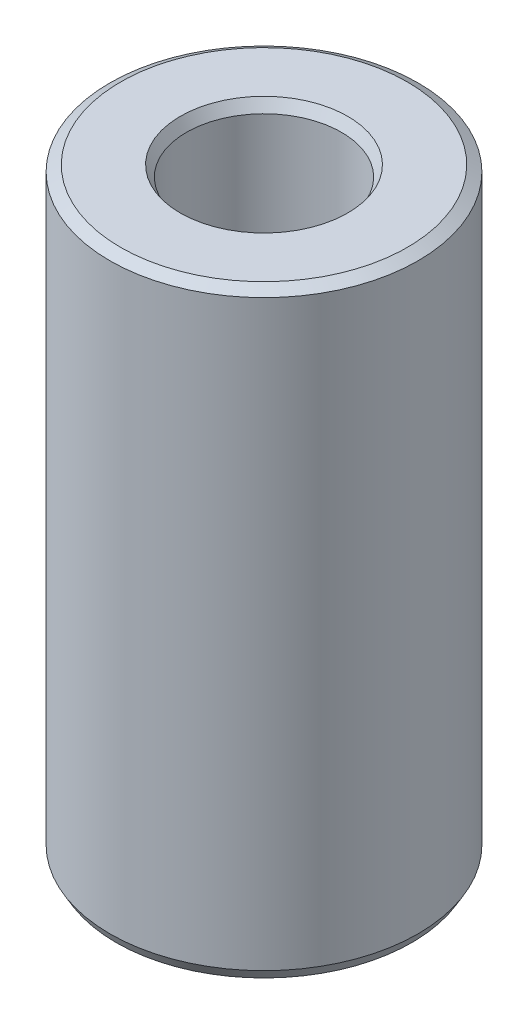
ISO-10303-21;
HEADER;
FILE_DESCRIPTION(('STEP AP214'),'2;1');
FILE_NAME('part.step','',(''),(''),'','','');
FILE_SCHEMA(('AUTOMOTIVE_DESIGN { 1 0 10303 214 1 1 1 1 }'));
ENDSEC;
DATA;
#1=APPLICATION_CONTEXT('core data for automotive mechanical design processes');
#2=APPLICATION_PROTOCOL_DEFINITION('international standard','automotive_design',2000,#1);
#3=PRODUCT_CONTEXT('',#1,'mechanical');
#4=PRODUCT('Part','Part','',(#3));
#5=PRODUCT_RELATED_PRODUCT_CATEGORY('part','',(#4));
#6=PRODUCT_DEFINITION_FORMATION('','',#4);
#7=PRODUCT_DEFINITION_CONTEXT('part definition',#1,'design');
#8=PRODUCT_DEFINITION('design','',#6,#7);
#9=PRODUCT_DEFINITION_SHAPE('','',#8);
#10=(LENGTH_UNIT() NAMED_UNIT(*) SI_UNIT(.MILLI.,.METRE.));
#11=(NAMED_UNIT(*) PLANE_ANGLE_UNIT() SI_UNIT($,.RADIAN.));
#12=(NAMED_UNIT(*) SI_UNIT($,.STERADIAN.) SOLID_ANGLE_UNIT());
#13=UNCERTAINTY_MEASURE_WITH_UNIT(LENGTH_MEASURE(1.E-05),#10,'distance_accuracy_value','');
#14=(GEOMETRIC_REPRESENTATION_CONTEXT(3) GLOBAL_UNCERTAINTY_ASSIGNED_CONTEXT((#13)) GLOBAL_UNIT_ASSIGNED_CONTEXT((#10,
#11,#12)) REPRESENTATION_CONTEXT('',''));
#15=CARTESIAN_POINT('',(0.,0.,0.));
#16=DIRECTION('',(0.,0.,1.));
#17=DIRECTION('',(1.,0.,0.));
#18=AXIS2_PLACEMENT_3D('',#15,#16,#17);
#19=CARTESIAN_POINT('',(0.,204.351669063772,0.));
#20=DIRECTION('',(0.,-1.,0.));
#21=DIRECTION('',(0.,0.,-1.));
#22=AXIS2_PLACEMENT_3D('',#19,#20,#21);
#23=CYLINDRICAL_SURFACE('',#22,52.5);
#24=CARTESIAN_POINT('',(0.,3.659429780245,0.));
#25=DIRECTION('',(0.,1.,0.));
#26=DIRECTION('',(0.,0.,1.));
#27=AXIS2_PLACEMENT_3D('',#24,#25,#26);
#28=CIRCLE('',#27,52.5);
#29=CARTESIAN_POINT('',(0.,3.659429780245,52.5));
#30=VERTEX_POINT('',#29);
#31=EDGE_CURVE('E10',#30,#30,#28,.T.);
#32=ORIENTED_EDGE('',*,*,#31,.T.);
#33=EDGE_LOOP('',(#32));
#34=FACE_BOUND('',#33,.T.);
#35=CARTESIAN_POINT('',(0.,202.238896295067,0.));
#36=DIRECTION('',(0.,1.,0.));
#37=DIRECTION('',(0.,0.,1.));
#38=AXIS2_PLACEMENT_3D('',#35,#36,#37);
#39=CIRCLE('',#38,52.5);
#40=CARTESIAN_POINT('',(0.,202.238896295067,52.5));
#41=VERTEX_POINT('',#40);
#42=EDGE_CURVE('E50',#41,#41,#39,.F.);
#43=ORIENTED_EDGE('',*,*,#42,.T.);
#44=EDGE_LOOP('',(#43));
#45=FACE_BOUND('',#44,.T.);
#46=ADVANCED_FACE('F39',(#34,#45),#23,.T.);
#47=CARTESIAN_POINT('',(0.,204.351669063772,0.));
#48=DIRECTION('',(0.,1.,0.));
#49=DIRECTION('',(0.,0.,1.));
#50=AXIS2_PLACEMENT_3D('',#47,#48,#49);
#51=PLANE('',#50);
#52=CARTESIAN_POINT('',(0.,204.351669063772,0.));
#53=DIRECTION('',(0.,1.,0.));
#54=DIRECTION('',(0.,0.,1.));
#55=AXIS2_PLACEMENT_3D('',#52,#53,#54);
#56=CIRCLE('',#55,28.5397225921579);
#57=CARTESIAN_POINT('',(0.,204.351669063772,28.5397225921579));
#58=VERTEX_POINT('',#57);
#59=EDGE_CURVE('E58',#58,#58,#56,.F.);
#60=ORIENTED_EDGE('',*,*,#59,.T.);
#61=EDGE_LOOP('',(#60));
#62=FACE_BOUND('',#61,.T.);
#63=CARTESIAN_POINT('',(0.,204.351669063772,0.));
#64=DIRECTION('',(0.,1.,0.));
#65=DIRECTION('',(0.,0.,1.));
#66=AXIS2_PLACEMENT_3D('',#63,#64,#65);
#67=CIRCLE('',#66,48.8405702197549);
#68=CARTESIAN_POINT('',(0.,204.351669063772,48.8405702197549));
#69=VERTEX_POINT('',#68);
#70=EDGE_CURVE('E61',#69,#69,#67,.T.);
#71=ORIENTED_EDGE('',*,*,#70,.T.);
#72=EDGE_LOOP('',(#71));
#73=FACE_BOUND('',#72,.T.);
#74=ADVANCED_FACE('F88',(#62,#73),#51,.T.);
#75=CARTESIAN_POINT('',(0.,0.,0.));
#76=DIRECTION('',(0.,1.,0.));
#77=DIRECTION('',(0.,0.,1.));
#78=AXIS2_PLACEMENT_3D('',#75,#76,#77);
#79=PLANE('',#78);
#80=CARTESIAN_POINT('',(0.,0.,0.));
#81=DIRECTION('',(0.,1.,0.));
#82=DIRECTION('',(0.,0.,1.));
#83=AXIS2_PLACEMENT_3D('',#80,#81,#82);
#84=CIRCLE('',#83,30.0863796036978);
#85=CARTESIAN_POINT('',(0.,0.,30.0863796036978));
#86=VERTEX_POINT('',#85);
#87=EDGE_CURVE('E51',#86,#86,#84,.T.);
#88=ORIENTED_EDGE('',*,*,#87,.T.);
#89=EDGE_LOOP('',(#88));
#90=FACE_BOUND('',#89,.T.);
#91=CARTESIAN_POINT('',(0.,0.,0.));
#92=DIRECTION('',(0.,1.,0.));
#93=DIRECTION('',(0.,0.,1.));
#94=AXIS2_PLACEMENT_3D('',#91,#92,#93);
#95=CIRCLE('',#94,50.387227231295);
#96=CARTESIAN_POINT('',(0.,0.,50.387227231295));
#97=VERTEX_POINT('',#96);
#98=EDGE_CURVE('E54',#97,#97,#95,.F.);
#99=ORIENTED_EDGE('',*,*,#98,.T.);
#100=EDGE_LOOP('',(#99));
#101=FACE_BOUND('',#100,.T.);
#102=ADVANCED_FACE('F83',(#90,#101),#79,.F.);
#103=CARTESIAN_POINT('',(0.,204.351669063772,0.));
#104=DIRECTION('',(0.,-1.,0.));
#105=DIRECTION('',(0.,0.,-1.));
#106=AXIS2_PLACEMENT_3D('',#103,#104,#105);
#107=CYLINDRICAL_SURFACE('',#106,26.4269498234528);
#108=CARTESIAN_POINT('',(0.,200.692239283527,0.));
#109=DIRECTION('',(0.,1.,0.));
#110=DIRECTION('',(0.,0.,1.));
#111=AXIS2_PLACEMENT_3D('',#108,#109,#110);
#112=CIRCLE('',#111,26.4269498234528);
#113=CARTESIAN_POINT('',(0.,200.692239283527,26.4269498234528));
#114=VERTEX_POINT('',#113);
#115=EDGE_CURVE('E67',#114,#114,#112,.T.);
#116=ORIENTED_EDGE('',*,*,#115,.T.);
#117=EDGE_LOOP('',(#116));
#118=FACE_BOUND('',#117,.T.);
#119=CARTESIAN_POINT('',(0.,2.11277276870503,0.));
#120=DIRECTION('',(0.,1.,0.));
#121=DIRECTION('',(0.,0.,1.));
#122=AXIS2_PLACEMENT_3D('',#119,#120,#121);
#123=CIRCLE('',#122,26.4269498234528);
#124=CARTESIAN_POINT('',(0.,2.11277276870503,26.4269498234528));
#125=VERTEX_POINT('',#124);
#126=EDGE_CURVE('E69',#125,#125,#123,.F.);
#127=ORIENTED_EDGE('',*,*,#126,.T.);
#128=EDGE_LOOP('',(#127));
#129=FACE_BOUND('',#128,.T.);
#130=ADVANCED_FACE('F71',(#118,#129),#107,.F.);
#131=CARTESIAN_POINT('',(0.,200.692239283527,0.));
#132=DIRECTION('',(0.,1.,0.));
#133=DIRECTION('',(0.,0.,1.));
#134=AXIS2_PLACEMENT_3D('',#131,#132,#133);
#135=CONICAL_SURFACE('',#134,26.4269498234528,0.523598775598299);
#136=CARTESIAN_POINT('',(0.,204.351669063772,28.5397225921579));
#137=CARTESIAN_POINT('',(0.,204.313550003561,28.5177145424839));
#138=CARTESIAN_POINT('',(0.,204.275430943351,28.4957064928098));
#139=CARTESIAN_POINT('',(0.,204.199192822929,28.4516903934618));
#140=CARTESIAN_POINT('',(0.,204.161073762718,28.4296823437878));
#141=CARTESIAN_POINT('',(0.,204.084835642296,28.3856662444398));
#142=CARTESIAN_POINT('',(0.,204.046716582085,28.3636581947658));
#143=CARTESIAN_POINT('',(0.,203.970478461663,28.3196420954177));
#144=CARTESIAN_POINT('',(0.,203.932359401453,28.2976340457437));
#145=CARTESIAN_POINT('',(0.,203.856121281031,28.2536179463957));
#146=CARTESIAN_POINT('',(0.,203.81800222082,28.2316098967217));
#147=CARTESIAN_POINT('',(0.,203.741764100398,28.1875937973737));
#148=CARTESIAN_POINT('',(0.,203.703645040187,28.1655857476997));
#149=CARTESIAN_POINT('',(0.,203.627406919765,28.1215696483517));
#150=CARTESIAN_POINT('',(0.,203.589287859555,28.0995615986776));
#151=CARTESIAN_POINT('',(0.,203.513049739133,28.0555454993296));
#152=CARTESIAN_POINT('',(0.,203.474930678922,28.0335374496556));
#153=CARTESIAN_POINT('',(0.,203.3986925585,27.9895213503076));
#154=CARTESIAN_POINT('',(0.,203.360573498289,27.9675133006336));
#155=CARTESIAN_POINT('',(0.,203.284335377867,27.9234972012856));
#156=CARTESIAN_POINT('',(0.,203.246216317657,27.9014891516115));
#157=CARTESIAN_POINT('',(0.,203.169978197235,27.8574730522635));
#158=CARTESIAN_POINT('',(0.,203.131859137024,27.8354650025895));
#159=CARTESIAN_POINT('',(0.,203.055621016602,27.7914489032415));
#160=CARTESIAN_POINT('',(0.,203.017501956391,27.7694408535675));
#161=CARTESIAN_POINT('',(0.,202.941263835969,27.7254247542195));
#162=CARTESIAN_POINT('',(0.,202.903144775759,27.7034167045454));
#163=CARTESIAN_POINT('',(0.,202.826906655337,27.6594006051974));
#164=CARTESIAN_POINT('',(0.,202.788787595126,27.6373925555234));
#165=CARTESIAN_POINT('',(0.,202.712549474704,27.5933764561754));
#166=CARTESIAN_POINT('',(0.,202.674430414493,27.5713684065014));
#167=CARTESIAN_POINT('',(0.,202.598192294071,27.5273523071534));
#168=CARTESIAN_POINT('',(0.,202.560073233861,27.5053442574793));
#169=CARTESIAN_POINT('',(0.,202.483835113439,27.4613281581313));
#170=CARTESIAN_POINT('',(0.,202.445716053228,27.4393201084573));
#171=CARTESIAN_POINT('',(0.,202.369477932806,27.3953040091093));
#172=CARTESIAN_POINT('',(0.,202.331358872595,27.3732959594353));
#173=CARTESIAN_POINT('',(0.,202.255120752173,27.3292798600873));
#174=CARTESIAN_POINT('',(0.,202.217001691963,27.3072718104132));
#175=CARTESIAN_POINT('',(0.,202.140763571541,27.2632557110652));
#176=CARTESIAN_POINT('',(0.,202.10264451133,27.2412476613912));
#177=CARTESIAN_POINT('',(0.,202.026406390908,27.1972315620432));
#178=CARTESIAN_POINT('',(0.,201.988287330697,27.1752235123692));
#179=CARTESIAN_POINT('',(0.,201.912049210276,27.1312074130212));
#180=CARTESIAN_POINT('',(0.,201.873930150065,27.1091993633472));
#181=CARTESIAN_POINT('',(0.,201.797692029643,27.0651832639991));
#182=CARTESIAN_POINT('',(0.,201.759572969432,27.0431752143251));
#183=CARTESIAN_POINT('',(0.,201.68333484901,26.9991591149771));
#184=CARTESIAN_POINT('',(0.,201.645215788799,26.9771510653031));
#185=CARTESIAN_POINT('',(0.,201.568977668378,26.9331349659551));
#186=CARTESIAN_POINT('',(0.,201.530858608167,26.9111269162811));
#187=CARTESIAN_POINT('',(0.,201.454620487745,26.867110816933));
#188=CARTESIAN_POINT('',(0.,201.416501427534,26.845102767259));
#189=CARTESIAN_POINT('',(0.,201.340263307112,26.801086667911));
#190=CARTESIAN_POINT('',(0.,201.302144246901,26.779078618237));
#191=CARTESIAN_POINT('',(0.,201.22590612648,26.735062518889));
#192=CARTESIAN_POINT('',(0.,201.187787066269,26.713054469215));
#193=CARTESIAN_POINT('',(0.,201.111548945847,26.6690383698669));
#194=CARTESIAN_POINT('',(0.,201.073429885636,26.6470303201929));
#195=CARTESIAN_POINT('',(0.,200.997191765214,26.6030142208449));
#196=CARTESIAN_POINT('',(0.,200.959072705003,26.5810061711709));
#197=CARTESIAN_POINT('',(0.,200.882834584582,26.5369900718229));
#198=CARTESIAN_POINT('',(0.,200.844715524371,26.5149820221489));
#199=CARTESIAN_POINT('',(0.,200.768477403949,26.4709659228008));
#200=CARTESIAN_POINT('',(0.,200.730358343738,26.4489578731268));
#201=CARTESIAN_POINT('',(0.,200.692239283527,26.4269498234528));
#202=B_SPLINE_CURVE_WITH_KNOTS('',3,(#136,#137,#138,#139,#140,#141,#142,#143,#144,#145,#146,
#147,#148,#149,#150,#151,#152,#153,#154,#155,#156,#157,#158,#159,#160,#161,#162,#163,#164,#165,
#166,#167,#168,#169,#170,#171,#172,#173,#174,#175,#176,#177,#178,#179,#180,#181,#182,#183,#184,
#185,#186,#187,#188,#189,#190,#191,#192,#193,#194,#195,#196,#197,#198,#199,#200,#201),
.UNSPECIFIED.,.F.,.F.,(4,2,2,2,2,2,2,2,2,2,2,2,2,2,2,2,2,2,2,2,2,2,2,2,2,2,2,2,2,2,2,2,4),(0.,
0.132048298044063,0.264096596088128,0.396144894132191,0.528193192176253,0.660241490220316,
0.792289788264379,0.924338086308444,1.05638638435251,1.18843468239657,1.32048298044063,
1.45253127848472,1.58457957652878,1.71662787457285,1.84867617261691,1.98072447066097,
2.11277276870504,2.2448210667491,2.37686936479316,2.50891766283723,2.64096596088129,
2.77301425892535,2.90506255696944,3.03711085501351,3.16915915305757,3.30120745110163,
3.43325574914569,3.56530404718976,3.69735234523382,3.82940064327789,3.96144894132195,
4.09349723936601,4.22554553741007),.UNSPECIFIED.);
#203=EDGE_CURVE('BSEAM77',#58,#114,#202,.T.);
#204=ORIENTED_EDGE('',*,*,#59,.F.);
#205=ORIENTED_EDGE('',*,*,#115,.F.);
#206=ORIENTED_EDGE('',*,*,#203,.T.);
#207=ORIENTED_EDGE('',*,*,#203,.F.);
#208=EDGE_LOOP('',(#204,#206,#205,#207));
#209=FACE_BOUND('',#208,.T.);
#210=ADVANCED_FACE('F77',(#209),#135,.F.);
#211=CARTESIAN_POINT('',(0.,0.,0.));
#212=DIRECTION('',(0.,-1.,0.));
#213=DIRECTION('',(0.,0.,-1.));
#214=AXIS2_PLACEMENT_3D('',#211,#212,#213);
#215=CONICAL_SURFACE('',#214,30.0863796036978,1.04719755119659);
#216=ORIENTED_EDGE('',*,*,#126,.F.);
#217=EDGE_LOOP('',(#216));
#218=FACE_BOUND('',#217,.T.);
#219=ORIENTED_EDGE('',*,*,#87,.F.);
#220=EDGE_LOOP('',(#219));
#221=FACE_BOUND('',#220,.T.);
#222=ADVANCED_FACE('F73',(#218,#221),#215,.F.);
#223=CARTESIAN_POINT('',(0.,3.659429780245,0.));
#224=DIRECTION('',(0.,1.,0.));
#225=DIRECTION('',(0.,0.,1.));
#226=AXIS2_PLACEMENT_3D('',#223,#224,#225);
#227=CONICAL_SURFACE('',#226,52.5,0.523598775598304);
#228=ORIENTED_EDGE('',*,*,#98,.F.);
#229=EDGE_LOOP('',(#228));
#230=FACE_BOUND('',#229,.T.);
#231=ORIENTED_EDGE('',*,*,#31,.F.);
#232=EDGE_LOOP('',(#231));
#233=FACE_BOUND('',#232,.T.);
#234=ADVANCED_FACE('F76',(#230,#233),#227,.T.);
#235=CARTESIAN_POINT('',(0.,204.351669063772,0.));
#236=DIRECTION('',(0.,-1.,0.));
#237=DIRECTION('',(0.,0.,-1.));
#238=AXIS2_PLACEMENT_3D('',#235,#236,#237);
#239=CONICAL_SURFACE('',#238,48.8405702197549,1.0471975511966);
#240=ORIENTED_EDGE('',*,*,#42,.F.);
#241=EDGE_LOOP('',(#240));
#242=FACE_BOUND('',#241,.T.);
#243=ORIENTED_EDGE('',*,*,#70,.F.);
#244=EDGE_LOOP('',(#243));
#245=FACE_BOUND('',#244,.T.);
#246=ADVANCED_FACE('F45',(#242,#245),#239,.T.);
#247=CLOSED_SHELL('',(#46,#74,#102,#130,#210,#222,#234,#246));
#248=MANIFOLD_SOLID_BREP('B2',#247);
#249=ADVANCED_BREP_SHAPE_REPRESENTATION('',(#18,#248),#14);
#250=SHAPE_DEFINITION_REPRESENTATION(#9,#249);
ENDSEC;
END-ISO-10303-21;
